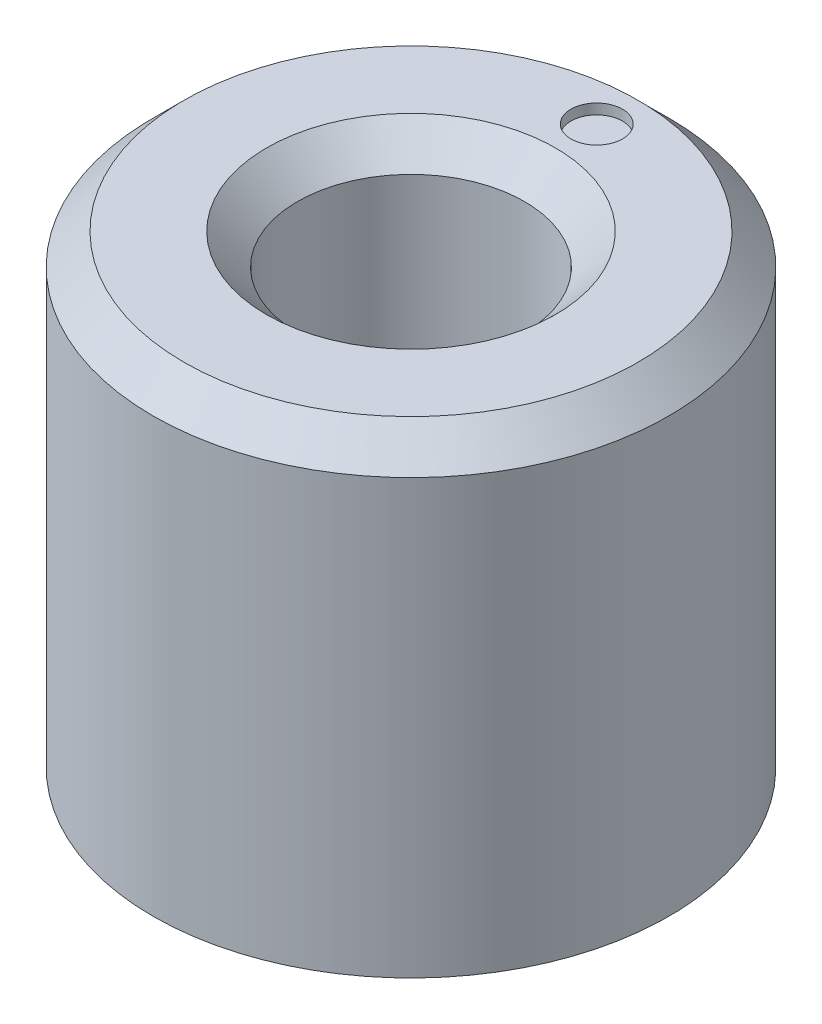
ISO-10303-21;
HEADER;
FILE_DESCRIPTION(('STEP AP214'),'2;1');
FILE_NAME('part.step','',(''),(''),'','','');
FILE_SCHEMA(('AUTOMOTIVE_DESIGN { 1 0 10303 214 1 1 1 1 }'));
ENDSEC;
DATA;
#1=APPLICATION_CONTEXT('core data for automotive mechanical design processes');
#2=APPLICATION_PROTOCOL_DEFINITION('international standard','automotive_design',2000,#1);
#3=PRODUCT_CONTEXT('',#1,'mechanical');
#4=PRODUCT('Part','Part','',(#3));
#5=PRODUCT_RELATED_PRODUCT_CATEGORY('part','',(#4));
#6=PRODUCT_DEFINITION_FORMATION('','',#4);
#7=PRODUCT_DEFINITION_CONTEXT('part definition',#1,'design');
#8=PRODUCT_DEFINITION('design','',#6,#7);
#9=PRODUCT_DEFINITION_SHAPE('','',#8);
#10=(LENGTH_UNIT() NAMED_UNIT(*) SI_UNIT(.MILLI.,.METRE.));
#11=(NAMED_UNIT(*) PLANE_ANGLE_UNIT() SI_UNIT($,.RADIAN.));
#12=(NAMED_UNIT(*) SI_UNIT($,.STERADIAN.) SOLID_ANGLE_UNIT());
#13=UNCERTAINTY_MEASURE_WITH_UNIT(LENGTH_MEASURE(1.E-05),#10,'distance_accuracy_value','');
#14=(GEOMETRIC_REPRESENTATION_CONTEXT(3) GLOBAL_UNCERTAINTY_ASSIGNED_CONTEXT((#13)) GLOBAL_UNIT_ASSIGNED_CONTEXT((#10,
#11,#12)) REPRESENTATION_CONTEXT('',''));
#15=CARTESIAN_POINT('',(0.,0.,0.));
#16=DIRECTION('',(0.,0.,1.));
#17=DIRECTION('',(1.,0.,0.));
#18=AXIS2_PLACEMENT_3D('',#15,#16,#17);
#19=CARTESIAN_POINT('',(0.,9.,0.));
#20=DIRECTION('',(0.,-1.,0.));
#21=DIRECTION('',(0.,0.,-1.));
#22=AXIS2_PLACEMENT_3D('',#19,#20,#21);
#23=CYLINDRICAL_SURFACE('',#22,5.);
#24=CARTESIAN_POINT('',(0.,8.4,0.));
#25=DIRECTION('',(0.,1.,0.));
#26=DIRECTION('',(0.,0.,1.));
#27=AXIS2_PLACEMENT_3D('',#24,#25,#26);
#28=CIRCLE('',#27,5.);
#29=CARTESIAN_POINT('',(0.,8.4,5.));
#30=VERTEX_POINT('',#29);
#31=EDGE_CURVE('E10',#30,#30,#28,.F.);
#32=ORIENTED_EDGE('',*,*,#31,.T.);
#33=EDGE_LOOP('',(#32));
#34=FACE_BOUND('',#33,.T.);
#35=CARTESIAN_POINT('',(0.,0.,0.));
#36=DIRECTION('',(0.,1.,0.));
#37=DIRECTION('',(0.,0.,1.));
#38=AXIS2_PLACEMENT_3D('',#35,#36,#37);
#39=CIRCLE('',#38,5.);
#40=CARTESIAN_POINT('',(0.,0.,5.));
#41=VERTEX_POINT('',#40);
#42=EDGE_CURVE('E60',#41,#41,#39,.T.);
#43=ORIENTED_EDGE('',*,*,#42,.T.);
#44=EDGE_LOOP('',(#43));
#45=FACE_BOUND('',#44,.T.);
#46=ADVANCED_FACE('F39',(#34,#45),#23,.T.);
#47=CARTESIAN_POINT('',(0.,9.,0.));
#48=DIRECTION('',(0.,1.,0.));
#49=DIRECTION('',(0.,0.,1.));
#50=AXIS2_PLACEMENT_3D('',#47,#48,#49);
#51=PLANE('',#50);
#52=CARTESIAN_POINT('',(0.,9.,0.));
#53=DIRECTION('',(0.,1.,0.));
#54=DIRECTION('',(0.,0.,1.));
#55=AXIS2_PLACEMENT_3D('',#52,#53,#54);
#56=CIRCLE('',#55,2.8);
#57=CARTESIAN_POINT('',(0.,9.,2.8));
#58=VERTEX_POINT('',#57);
#59=EDGE_CURVE('E47',#58,#58,#56,.F.);
#60=ORIENTED_EDGE('',*,*,#59,.T.);
#61=EDGE_LOOP('',(#60));
#62=FACE_BOUND('',#61,.T.);
#63=CARTESIAN_POINT('',(0.,9.,0.));
#64=DIRECTION('',(0.,1.,0.));
#65=DIRECTION('',(0.,0.,1.));
#66=AXIS2_PLACEMENT_3D('',#63,#64,#65);
#67=CIRCLE('',#66,4.4);
#68=CARTESIAN_POINT('',(0.,9.,4.4));
#69=VERTEX_POINT('',#68);
#70=EDGE_CURVE('E51',#69,#69,#67,.T.);
#71=ORIENTED_EDGE('',*,*,#70,.T.);
#72=EDGE_LOOP('',(#71));
#73=FACE_BOUND('',#72,.T.);
#74=CARTESIAN_POINT('',(0.,9.,-3.6));
#75=DIRECTION('',(0.,1.,0.));
#76=DIRECTION('',(0.,0.,1.));
#77=AXIS2_PLACEMENT_3D('',#74,#75,#76);
#78=CIRCLE('',#77,0.5);
#79=CARTESIAN_POINT('',(0.,9.,-3.1));
#80=VERTEX_POINT('',#79);
#81=EDGE_CURVE('E67',#80,#80,#78,.T.);
#82=ORIENTED_EDGE('',*,*,#81,.F.);
#83=EDGE_LOOP('',(#82));
#84=FACE_BOUND('',#83,.T.);
#85=ADVANCED_FACE('F82',(#62,#73,#84),#51,.T.);
#86=CARTESIAN_POINT('',(0.,0.,0.));
#87=DIRECTION('',(0.,1.,0.));
#88=DIRECTION('',(0.,0.,1.));
#89=AXIS2_PLACEMENT_3D('',#86,#87,#88);
#90=PLANE('',#89);
#91=CARTESIAN_POINT('',(0.,0.,0.));
#92=DIRECTION('',(0.,1.,0.));
#93=DIRECTION('',(0.,0.,1.));
#94=AXIS2_PLACEMENT_3D('',#91,#92,#93);
#95=CIRCLE('',#94,2.2);
#96=CARTESIAN_POINT('',(0.,0.,2.2));
#97=VERTEX_POINT('',#96);
#98=EDGE_CURVE('E63',#97,#97,#95,.T.);
#99=ORIENTED_EDGE('',*,*,#98,.T.);
#100=EDGE_LOOP('',(#99));
#101=FACE_BOUND('',#100,.T.);
#102=ORIENTED_EDGE('',*,*,#42,.F.);
#103=EDGE_LOOP('',(#102));
#104=FACE_BOUND('',#103,.T.);
#105=ADVANCED_FACE('F84',(#101,#104),#90,.F.);
#106=CARTESIAN_POINT('',(0.,9.,0.));
#107=DIRECTION('',(0.,-1.,0.));
#108=DIRECTION('',(0.,0.,-1.));
#109=AXIS2_PLACEMENT_3D('',#106,#107,#108);
#110=CYLINDRICAL_SURFACE('',#109,2.2);
#111=CARTESIAN_POINT('',(0.,8.4,0.));
#112=DIRECTION('',(0.,1.,0.));
#113=DIRECTION('',(0.,0.,1.));
#114=AXIS2_PLACEMENT_3D('',#111,#112,#113);
#115=CIRCLE('',#114,2.2);
#116=CARTESIAN_POINT('',(0.,8.4,2.2));
#117=VERTEX_POINT('',#116);
#118=EDGE_CURVE('E55',#117,#117,#115,.T.);
#119=ORIENTED_EDGE('',*,*,#118,.T.);
#120=EDGE_LOOP('',(#119));
#121=FACE_BOUND('',#120,.T.);
#122=ORIENTED_EDGE('',*,*,#98,.F.);
#123=EDGE_LOOP('',(#122));
#124=FACE_BOUND('',#123,.T.);
#125=ADVANCED_FACE('F78',(#121,#124),#110,.F.);
#126=CARTESIAN_POINT('',(0.,8.8,-3.6));
#127=DIRECTION('',(0.,1.,0.));
#128=DIRECTION('',(0.,0.,1.));
#129=AXIS2_PLACEMENT_3D('',#126,#127,#128);
#130=CYLINDRICAL_SURFACE('',#129,0.5);
#131=CARTESIAN_POINT('',(0.,8.8,-3.6));
#132=DIRECTION('',(0.,1.,0.));
#133=DIRECTION('',(0.,0.,1.));
#134=AXIS2_PLACEMENT_3D('',#131,#132,#133);
#135=CIRCLE('',#134,0.5);
#136=CARTESIAN_POINT('',(0.,8.8,-3.1));
#137=VERTEX_POINT('',#136);
#138=EDGE_CURVE('E66',#137,#137,#135,.T.);
#139=ORIENTED_EDGE('',*,*,#138,.F.);
#140=EDGE_LOOP('',(#139));
#141=FACE_BOUND('',#140,.T.);
#142=ORIENTED_EDGE('',*,*,#81,.T.);
#143=EDGE_LOOP('',(#142));
#144=FACE_BOUND('',#143,.T.);
#145=ADVANCED_FACE('F75',(#141,#144),#130,.F.);
#146=CARTESIAN_POINT('',(0.,8.8,-3.6));
#147=DIRECTION('',(0.,1.,0.));
#148=DIRECTION('',(0.,0.,1.));
#149=AXIS2_PLACEMENT_3D('',#146,#147,#148);
#150=PLANE('',#149);
#151=ORIENTED_EDGE('',*,*,#138,.T.);
#152=EDGE_LOOP('',(#151));
#153=FACE_BOUND('',#152,.T.);
#154=ADVANCED_FACE('F73',(#153),#150,.T.);
#155=CARTESIAN_POINT('',(0.,8.4,0.));
#156=DIRECTION('',(0.,1.,0.));
#157=DIRECTION('',(0.,0.,1.));
#158=AXIS2_PLACEMENT_3D('',#155,#156,#157);
#159=CONICAL_SURFACE('',#158,2.2,0.785398163397449);
#160=ORIENTED_EDGE('',*,*,#59,.F.);
#161=EDGE_LOOP('',(#160));
#162=FACE_BOUND('',#161,.T.);
#163=ORIENTED_EDGE('',*,*,#118,.F.);
#164=EDGE_LOOP('',(#163));
#165=FACE_BOUND('',#164,.T.);
#166=ADVANCED_FACE('F97',(#162,#165),#159,.F.);
#167=CARTESIAN_POINT('',(0.,9.,0.));
#168=DIRECTION('',(0.,-1.,0.));
#169=DIRECTION('',(0.,0.,-1.));
#170=AXIS2_PLACEMENT_3D('',#167,#168,#169);
#171=CONICAL_SURFACE('',#170,4.4,0.785398163397444);
#172=ORIENTED_EDGE('',*,*,#31,.F.);
#173=EDGE_LOOP('',(#172));
#174=FACE_BOUND('',#173,.T.);
#175=ORIENTED_EDGE('',*,*,#70,.F.);
#176=EDGE_LOOP('',(#175));
#177=FACE_BOUND('',#176,.T.);
#178=ADVANCED_FACE('F42',(#174,#177),#171,.T.);
#179=CLOSED_SHELL('',(#46,#85,#105,#125,#145,#154,#166,#178));
#180=MANIFOLD_SOLID_BREP('B2',#179);
#181=ADVANCED_BREP_SHAPE_REPRESENTATION('',(#18,#180),#14);
#182=SHAPE_DEFINITION_REPRESENTATION(#9,#181);
ENDSEC;
END-ISO-10303-21;
